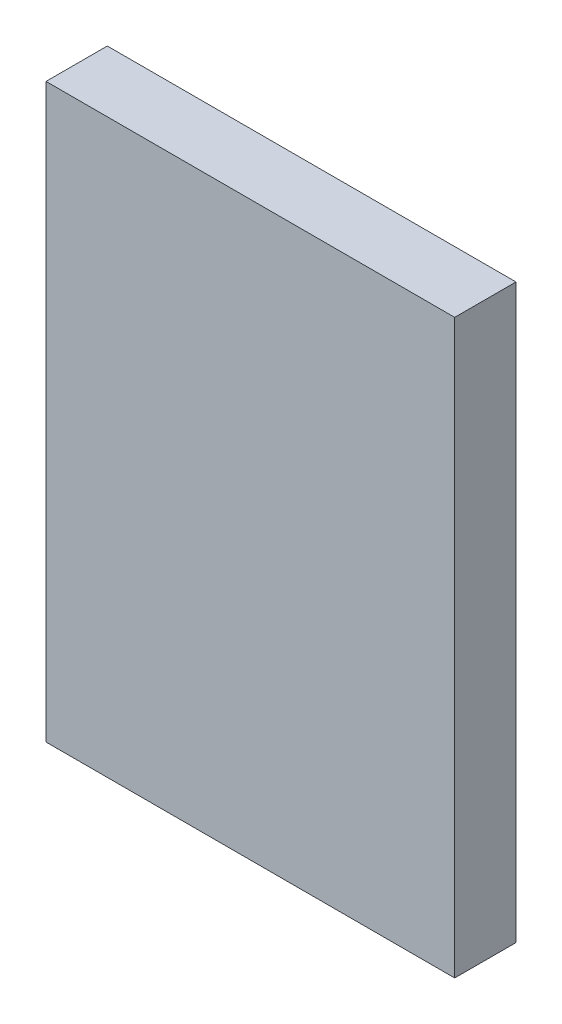
ISO-10303-21;
HEADER;
FILE_DESCRIPTION(('STEP AP214'),'2;1');
FILE_NAME('part.step','',(''),(''),'','','');
FILE_SCHEMA(('AUTOMOTIVE_DESIGN { 1 0 10303 214 1 1 1 1 }'));
ENDSEC;
DATA;
#1=APPLICATION_CONTEXT('core data for automotive mechanical design processes');
#2=APPLICATION_PROTOCOL_DEFINITION('international standard','automotive_design',2000,#1);
#3=PRODUCT_CONTEXT('',#1,'mechanical');
#4=PRODUCT('Part','Part','',(#3));
#5=PRODUCT_RELATED_PRODUCT_CATEGORY('part','',(#4));
#6=PRODUCT_DEFINITION_FORMATION('','',#4);
#7=PRODUCT_DEFINITION_CONTEXT('part definition',#1,'design');
#8=PRODUCT_DEFINITION('design','',#6,#7);
#9=PRODUCT_DEFINITION_SHAPE('','',#8);
#10=(LENGTH_UNIT() NAMED_UNIT(*) SI_UNIT(.MILLI.,.METRE.));
#11=(NAMED_UNIT(*) PLANE_ANGLE_UNIT() SI_UNIT($,.RADIAN.));
#12=(NAMED_UNIT(*) SI_UNIT($,.STERADIAN.) SOLID_ANGLE_UNIT());
#13=UNCERTAINTY_MEASURE_WITH_UNIT(LENGTH_MEASURE(1.E-05),#10,'distance_accuracy_value','');
#14=(GEOMETRIC_REPRESENTATION_CONTEXT(3) GLOBAL_UNCERTAINTY_ASSIGNED_CONTEXT((#13)) GLOBAL_UNIT_ASSIGNED_CONTEXT((#10,
#11,#12)) REPRESENTATION_CONTEXT('',''));
#15=CARTESIAN_POINT('',(0.,0.,0.));
#16=DIRECTION('',(0.,0.,1.));
#17=DIRECTION('',(1.,0.,0.));
#18=AXIS2_PLACEMENT_3D('',#15,#16,#17);
#19=CARTESIAN_POINT('',(20.,8.,6.));
#20=DIRECTION('',(-1.,0.,0.));
#21=DIRECTION('',(0.,0.,1.));
#22=AXIS2_PLACEMENT_3D('',#19,#20,#21);
#23=PLANE('',#22);
#24=DIRECTION('',(0.,1.,0.));
#25=VECTOR('',#24,1.);
#26=CARTESIAN_POINT('',(20.,8.,0.));
#27=LINE('',#26,#25);
#28=CARTESIAN_POINT('',(20.,-48.,0.));
#29=VERTEX_POINT('',#28);
#30=CARTESIAN_POINT('',(20.,8.,0.));
#31=VERTEX_POINT('',#30);
#32=EDGE_CURVE('E98',#29,#31,#27,.T.);
#33=ORIENTED_EDGE('',*,*,#32,.T.);
#34=DIRECTION('',(0.,0.,-1.));
#35=VECTOR('',#34,1.);
#36=CARTESIAN_POINT('',(20.,8.,6.));
#37=LINE('',#36,#35);
#38=CARTESIAN_POINT('',(20.,8.,6.));
#39=VERTEX_POINT('',#38);
#40=EDGE_CURVE('E11',#39,#31,#37,.T.);
#41=ORIENTED_EDGE('',*,*,#40,.F.);
#42=DIRECTION('',(0.,1.,0.));
#43=VECTOR('',#42,1.);
#44=CARTESIAN_POINT('',(20.,8.,6.));
#45=LINE('',#44,#43);
#46=CARTESIAN_POINT('',(20.,-48.,6.));
#47=VERTEX_POINT('',#46);
#48=EDGE_CURVE('E86',#47,#39,#45,.T.);
#49=ORIENTED_EDGE('',*,*,#48,.F.);
#50=DIRECTION('',(0.,0.,-1.));
#51=VECTOR('',#50,1.);
#52=CARTESIAN_POINT('',(20.,-48.,6.));
#53=LINE('',#52,#51);
#54=EDGE_CURVE('E94',#47,#29,#53,.T.);
#55=ORIENTED_EDGE('',*,*,#54,.T.);
#56=EDGE_LOOP('',(#33,#41,#49,#55));
#57=FACE_BOUND('',#56,.T.);
#58=ADVANCED_FACE('F35',(#57),#23,.F.);
#59=CARTESIAN_POINT('',(20.,8.,6.));
#60=DIRECTION('',(0.,-1.,0.));
#61=DIRECTION('',(0.,0.,-1.));
#62=AXIS2_PLACEMENT_3D('',#59,#60,#61);
#63=PLANE('',#62);
#64=DIRECTION('',(-1.,0.,0.));
#65=VECTOR('',#64,1.);
#66=CARTESIAN_POINT('',(20.,8.,0.));
#67=LINE('',#66,#65);
#68=CARTESIAN_POINT('',(-20.,8.,0.));
#69=VERTEX_POINT('',#68);
#70=EDGE_CURVE('E90',#31,#69,#67,.T.);
#71=ORIENTED_EDGE('',*,*,#70,.T.);
#72=DIRECTION('',(0.,0.,-1.));
#73=VECTOR('',#72,1.);
#74=CARTESIAN_POINT('',(-20.,8.,6.));
#75=LINE('',#74,#73);
#76=CARTESIAN_POINT('',(-20.,8.,6.));
#77=VERTEX_POINT('',#76);
#78=EDGE_CURVE('E43',#77,#69,#75,.T.);
#79=ORIENTED_EDGE('',*,*,#78,.F.);
#80=DIRECTION('',(-1.,0.,0.));
#81=VECTOR('',#80,1.);
#82=CARTESIAN_POINT('',(20.,8.,6.));
#83=LINE('',#82,#81);
#84=EDGE_CURVE('E81',#39,#77,#83,.T.);
#85=ORIENTED_EDGE('',*,*,#84,.F.);
#86=ORIENTED_EDGE('',*,*,#40,.T.);
#87=EDGE_LOOP('',(#71,#79,#85,#86));
#88=FACE_BOUND('',#87,.T.);
#89=ADVANCED_FACE('F89',(#88),#63,.F.);
#90=CARTESIAN_POINT('',(-20.,8.,6.));
#91=DIRECTION('',(1.,0.,0.));
#92=DIRECTION('',(0.,0.,-1.));
#93=AXIS2_PLACEMENT_3D('',#90,#91,#92);
#94=PLANE('',#93);
#95=DIRECTION('',(0.,-1.,0.));
#96=VECTOR('',#95,1.);
#97=CARTESIAN_POINT('',(-20.,8.,0.));
#98=LINE('',#97,#96);
#99=CARTESIAN_POINT('',(-20.,-48.,0.));
#100=VERTEX_POINT('',#99);
#101=EDGE_CURVE('E68',#69,#100,#98,.T.);
#102=ORIENTED_EDGE('',*,*,#101,.T.);
#103=DIRECTION('',(0.,0.,-1.));
#104=VECTOR('',#103,1.);
#105=CARTESIAN_POINT('',(-20.,-48.,6.));
#106=LINE('',#105,#104);
#107=CARTESIAN_POINT('',(-20.,-48.,6.));
#108=VERTEX_POINT('',#107);
#109=EDGE_CURVE('E91',#108,#100,#106,.T.);
#110=ORIENTED_EDGE('',*,*,#109,.F.);
#111=DIRECTION('',(0.,-1.,0.));
#112=VECTOR('',#111,1.);
#113=CARTESIAN_POINT('',(-20.,8.,6.));
#114=LINE('',#113,#112);
#115=EDGE_CURVE('E84',#77,#108,#114,.T.);
#116=ORIENTED_EDGE('',*,*,#115,.F.);
#117=ORIENTED_EDGE('',*,*,#78,.T.);
#118=EDGE_LOOP('',(#102,#110,#116,#117));
#119=FACE_BOUND('',#118,.T.);
#120=ADVANCED_FACE('F92',(#119),#94,.F.);
#121=CARTESIAN_POINT('',(20.,-48.,6.));
#122=DIRECTION('',(0.,1.,0.));
#123=DIRECTION('',(0.,0.,1.));
#124=AXIS2_PLACEMENT_3D('',#121,#122,#123);
#125=PLANE('',#124);
#126=DIRECTION('',(1.,0.,0.));
#127=VECTOR('',#126,1.);
#128=CARTESIAN_POINT('',(20.,-48.,0.));
#129=LINE('',#128,#127);
#130=EDGE_CURVE('E74',#100,#29,#129,.T.);
#131=ORIENTED_EDGE('',*,*,#130,.T.);
#132=ORIENTED_EDGE('',*,*,#54,.F.);
#133=DIRECTION('',(1.,0.,0.));
#134=VECTOR('',#133,1.);
#135=CARTESIAN_POINT('',(20.,-48.,6.));
#136=LINE('',#135,#134);
#137=EDGE_CURVE('E51',#108,#47,#136,.T.);
#138=ORIENTED_EDGE('',*,*,#137,.F.);
#139=ORIENTED_EDGE('',*,*,#109,.T.);
#140=EDGE_LOOP('',(#131,#132,#138,#139));
#141=FACE_BOUND('',#140,.T.);
#142=ADVANCED_FACE('F105',(#141),#125,.F.);
#143=CARTESIAN_POINT('',(0.,0.,6.));
#144=DIRECTION('',(0.,0.,-1.));
#145=DIRECTION('',(-1.,0.,0.));
#146=AXIS2_PLACEMENT_3D('',#143,#144,#145);
#147=PLANE('',#146);
#148=ORIENTED_EDGE('',*,*,#48,.T.);
#149=ORIENTED_EDGE('',*,*,#84,.T.);
#150=ORIENTED_EDGE('',*,*,#115,.T.);
#151=ORIENTED_EDGE('',*,*,#137,.T.);
#152=EDGE_LOOP('',(#148,#149,#150,#151));
#153=FACE_BOUND('',#152,.T.);
#154=ADVANCED_FACE('F82',(#153),#147,.F.);
#155=CARTESIAN_POINT('',(0.,0.,0.));
#156=DIRECTION('',(0.,0.,-1.));
#157=DIRECTION('',(-1.,0.,0.));
#158=AXIS2_PLACEMENT_3D('',#155,#156,#157);
#159=PLANE('',#158);
#160=ORIENTED_EDGE('',*,*,#32,.F.);
#161=ORIENTED_EDGE('',*,*,#130,.F.);
#162=ORIENTED_EDGE('',*,*,#101,.F.);
#163=ORIENTED_EDGE('',*,*,#70,.F.);
#164=EDGE_LOOP('',(#160,#161,#162,#163));
#165=FACE_BOUND('',#164,.T.);
#166=ADVANCED_FACE('F108',(#165),#159,.T.);
#167=CLOSED_SHELL('',(#58,#89,#120,#142,#154,#166));
#168=MANIFOLD_SOLID_BREP('B2',#167);
#169=ADVANCED_BREP_SHAPE_REPRESENTATION('',(#18,#168),#14);
#170=SHAPE_DEFINITION_REPRESENTATION(#9,#169);
ENDSEC;
END-ISO-10303-21;
